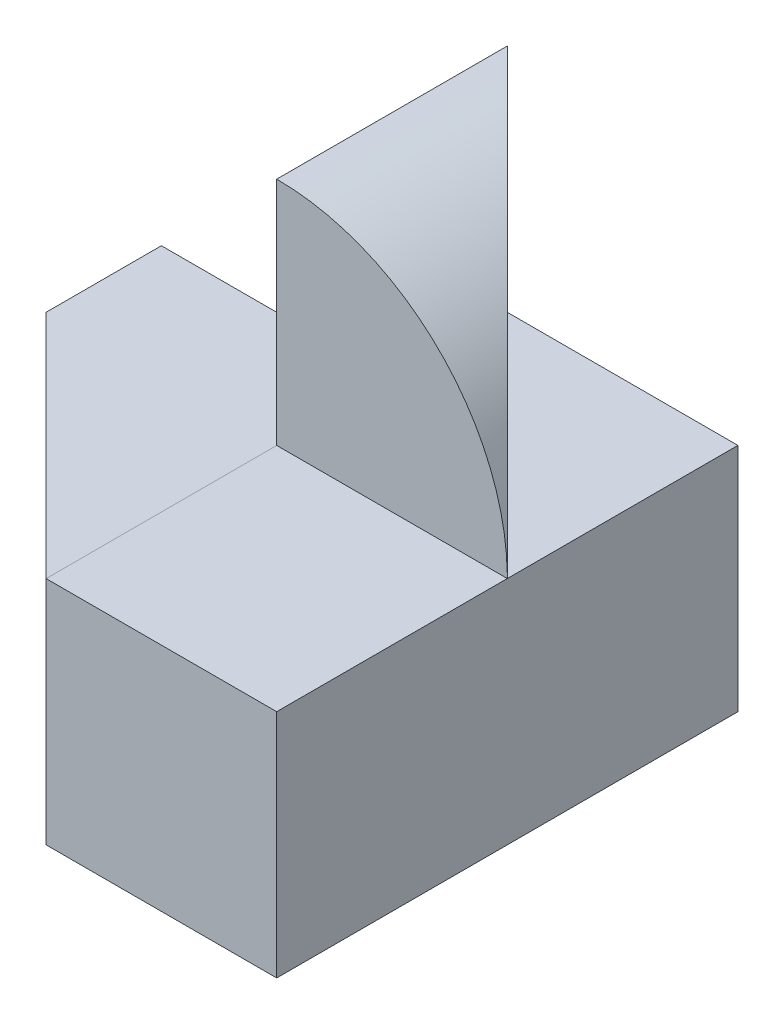
ISO-10303-21;
HEADER;
FILE_DESCRIPTION(('STEP AP214'),'2;1');
FILE_NAME('part.step','',(''),(''),'','','');
FILE_SCHEMA(('AUTOMOTIVE_DESIGN { 1 0 10303 214 1 1 1 1 }'));
ENDSEC;
DATA;
#1=APPLICATION_CONTEXT('core data for automotive mechanical design processes');
#2=APPLICATION_PROTOCOL_DEFINITION('international standard','automotive_design',2000,#1);
#3=PRODUCT_CONTEXT('',#1,'mechanical');
#4=PRODUCT('Part','Part','',(#3));
#5=PRODUCT_RELATED_PRODUCT_CATEGORY('part','',(#4));
#6=PRODUCT_DEFINITION_FORMATION('','',#4);
#7=PRODUCT_DEFINITION_CONTEXT('part definition',#1,'design');
#8=PRODUCT_DEFINITION('design','',#6,#7);
#9=PRODUCT_DEFINITION_SHAPE('','',#8);
#10=(LENGTH_UNIT() NAMED_UNIT(*) SI_UNIT(.MILLI.,.METRE.));
#11=(NAMED_UNIT(*) PLANE_ANGLE_UNIT() SI_UNIT($,.RADIAN.));
#12=(NAMED_UNIT(*) SI_UNIT($,.STERADIAN.) SOLID_ANGLE_UNIT());
#13=UNCERTAINTY_MEASURE_WITH_UNIT(LENGTH_MEASURE(1.E-05),#10,'distance_accuracy_value','');
#14=(GEOMETRIC_REPRESENTATION_CONTEXT(3) GLOBAL_UNCERTAINTY_ASSIGNED_CONTEXT((#13)) GLOBAL_UNIT_ASSIGNED_CONTEXT((#10,
#11,#12)) REPRESENTATION_CONTEXT('',''));
#15=CARTESIAN_POINT('',(0.,0.,0.));
#16=DIRECTION('',(0.,0.,1.));
#17=DIRECTION('',(1.,0.,0.));
#18=AXIS2_PLACEMENT_3D('',#15,#16,#17);
#19=CARTESIAN_POINT('',(0.,0.,0.));
#20=DIRECTION('',(0.,-1.,0.));
#21=DIRECTION('',(0.,0.,-1.));
#22=AXIS2_PLACEMENT_3D('',#19,#20,#21);
#23=PLANE('',#22);
#24=DIRECTION('',(1.,0.,0.));
#25=VECTOR('',#24,1.);
#26=CARTESIAN_POINT('',(-2.,0.,2.));
#27=LINE('',#26,#25);
#28=CARTESIAN_POINT('',(0.000305240086620776,0.,2.));
#29=VERTEX_POINT('',#28);
#30=CARTESIAN_POINT('',(2.,0.,2.));
#31=VERTEX_POINT('',#30);
#32=EDGE_CURVE('E168',#29,#31,#27,.T.);
#33=ORIENTED_EDGE('',*,*,#32,.F.);
#34=DIRECTION('',(0.707160730229535,0.,0.707052828027178));
#35=VECTOR('',#34,1.);
#36=CARTESIAN_POINT('',(-0.999847391603128,0.,0.999999976716006));
#37=LINE('',#36,#35);
#38=CARTESIAN_POINT('',(2.32893238651528E-08,-2.32893222935904E-08,1.99969482977424));
#39=VERTEX_POINT('',#38);
#40=EDGE_CURVE('E151',#39,#29,#37,.T.);
#41=ORIENTED_EDGE('',*,*,#40,.F.);
#42=DIRECTION('',(0.,0.,1.));
#43=VECTOR('',#42,1.);
#44=CARTESIAN_POINT('',(2.3289323594633E-08,-1.16446613636356E-08,0.));
#45=LINE('',#44,#43);
#46=CARTESIAN_POINT('',(2.3289323594633E-08,0.,0.));
#47=VERTEX_POINT('',#46);
#48=EDGE_CURVE('E160',#39,#47,#45,.F.);
#49=ORIENTED_EDGE('',*,*,#48,.T.);
#50=DIRECTION('',(1.,0.,0.));
#51=VECTOR('',#50,1.);
#52=CARTESIAN_POINT('',(-1.99999997671778,0.,0.));
#53=LINE('',#52,#51);
#54=CARTESIAN_POINT('',(-1.99999997671778,0.,0.));
#55=VERTEX_POINT('',#54);
#56=EDGE_CURVE('E144',#55,#47,#53,.T.);
#57=ORIENTED_EDGE('',*,*,#56,.F.);
#58=DIRECTION('',(0.,0.,1.));
#59=VECTOR('',#58,1.);
#60=CARTESIAN_POINT('',(-2.,0.,2.));
#61=LINE('',#60,#59);
#62=CARTESIAN_POINT('',(-2.,0.,-1.));
#63=VERTEX_POINT('',#62);
#64=EDGE_CURVE('E158',#63,#55,#61,.T.);
#65=ORIENTED_EDGE('',*,*,#64,.F.);
#66=CARTESIAN_POINT('',(-2.,0.,-2.));
#67=VERTEX_POINT('',#66);
#68=EDGE_CURVE('E165',#67,#63,#61,.T.);
#69=ORIENTED_EDGE('',*,*,#68,.F.);
#70=DIRECTION('',(-1.,0.,0.));
#71=VECTOR('',#70,1.);
#72=CARTESIAN_POINT('',(-2.,0.,-2.));
#73=LINE('',#72,#71);
#74=CARTESIAN_POINT('',(2.,0.,-2.));
#75=VERTEX_POINT('',#74);
#76=EDGE_CURVE('E166',#75,#67,#73,.T.);
#77=ORIENTED_EDGE('',*,*,#76,.F.);
#78=DIRECTION('',(0.,0.,-1.));
#79=VECTOR('',#78,1.);
#80=CARTESIAN_POINT('',(2.,0.,2.));
#81=LINE('',#80,#79);
#82=EDGE_CURVE('E170',#31,#75,#81,.T.);
#83=ORIENTED_EDGE('',*,*,#82,.F.);
#84=EDGE_LOOP('',(#33,#41,#49,#57,#65,#69,#77,#83));
#85=FACE_BOUND('',#84,.T.);
#86=ADVANCED_FACE('F54',(#85),#23,.T.);
#87=CARTESIAN_POINT('',(-2.,4.,2.));
#88=DIRECTION('',(1.,0.,0.));
#89=DIRECTION('',(0.,0.,-1.));
#90=AXIS2_PLACEMENT_3D('',#87,#88,#89);
#91=PLANE('',#90);
#92=DIRECTION('',(0.,1.,0.));
#93=VECTOR('',#92,1.);
#94=CARTESIAN_POINT('',(-2.,2.00000001164289,-1.));
#95=LINE('',#94,#93);
#96=CARTESIAN_POINT('',(-2.,2.00000001164289,-1.));
#97=VERTEX_POINT('',#96);
#98=EDGE_CURVE('E164',#63,#97,#95,.T.);
#99=ORIENTED_EDGE('',*,*,#98,.F.);
#100=ORIENTED_EDGE('',*,*,#64,.T.);
#101=DIRECTION('',(-1.16411092617487E-08,1.,0.));
#102=VECTOR('',#101,1.);
#103=CARTESIAN_POINT('',(-1.99999995343556,-2.,0.));
#104=LINE('',#103,#102);
#105=CARTESIAN_POINT('',(-2.,2.,0.));
#106=VERTEX_POINT('',#105);
#107=EDGE_CURVE('E141',#55,#106,#104,.T.);
#108=ORIENTED_EDGE('',*,*,#107,.T.);
#109=DIRECTION('',(0.,0.,1.));
#110=VECTOR('',#109,1.);
#111=CARTESIAN_POINT('',(-2.,2.00000001164289,-2.));
#112=LINE('',#111,#110);
#113=EDGE_CURVE('E188',#97,#106,#112,.T.);
#114=ORIENTED_EDGE('',*,*,#113,.F.);
#115=EDGE_LOOP('',(#99,#100,#108,#114));
#116=FACE_BOUND('',#115,.T.);
#117=ADVANCED_FACE('F163',(#116),#91,.F.);
#118=CARTESIAN_POINT('',(-2.32822187945282E-08,2.00000002328222,-2.));
#119=DIRECTION('',(-1.16411092617487E-08,1.,0.));
#120=DIRECTION('',(-1.,-1.16411092617487E-08,0.));
#121=AXIS2_PLACEMENT_3D('',#118,#119,#120);
#122=PLANE('',#121);
#123=DIRECTION('',(0.,0.,1.));
#124=VECTOR('',#123,1.);
#125=CARTESIAN_POINT('',(0.000305193522183662,2.00000002328577,-2.));
#126=LINE('',#125,#124);
#127=CARTESIAN_POINT('',(0.000305193522183662,2.00000002328577,-1.));
#128=VERTEX_POINT('',#127);
#129=CARTESIAN_POINT('',(0.000305193522183662,2.00000002328577,0.));
#130=VERTEX_POINT('',#129);
#131=EDGE_CURVE('E192',#128,#130,#126,.T.);
#132=ORIENTED_EDGE('',*,*,#131,.F.);
#133=DIRECTION('',(1.,5.82055452247066E-09,0.));
#134=VECTOR('',#133,1.);
#135=CARTESIAN_POINT('',(0.000305193522183662,2.00000002328577,-1.));
#136=LINE('',#135,#134);
#137=EDGE_CURVE('E264',#97,#128,#136,.T.);
#138=ORIENTED_EDGE('',*,*,#137,.F.);
#139=ORIENTED_EDGE('',*,*,#113,.T.);
#140=DIRECTION('',(-0.707160730229535,-8.23213523040343E-09,-0.707052828027178));
#141=VECTOR('',#140,1.);
#142=CARTESIAN_POINT('',(0.000305216804401982,2.00000002328577,2.));
#143=LINE('',#142,#141);
#144=CARTESIAN_POINT('',(0.000305193522183662,2.00000002328577,2.));
#145=VERTEX_POINT('',#144);
#146=EDGE_CURVE('E232',#145,#106,#143,.T.);
#147=ORIENTED_EDGE('',*,*,#146,.F.);
#148=DIRECTION('',(0.,0.,1.));
#149=VECTOR('',#148,1.);
#150=CARTESIAN_POINT('',(0.000305193522183662,2.00000002328577,2.));
#151=LINE('',#150,#149);
#152=EDGE_CURVE('E210',#130,#145,#151,.T.);
#153=ORIENTED_EDGE('',*,*,#152,.F.);
#154=EDGE_LOOP('',(#132,#138,#139,#147,#153));
#155=FACE_BOUND('',#154,.T.);
#156=ADVANCED_FACE('F277',(#155),#122,.T.);
#157=CARTESIAN_POINT('',(-2.,4.,-2.));
#158=DIRECTION('',(0.,0.,1.));
#159=DIRECTION('',(1.,0.,0.));
#160=AXIS2_PLACEMENT_3D('',#157,#158,#159);
#161=PLANE('',#160);
#162=ORIENTED_EDGE('',*,*,#76,.T.);
#163=DIRECTION('',(-0.707160721998656,-0.707052836259313,0.));
#164=VECTOR('',#163,1.);
#165=CARTESIAN_POINT('',(-2.,0.,-2.));
#166=LINE('',#165,#164);
#167=CARTESIAN_POINT('',(0.000305193522183662,2.00000002328577,-2.));
#168=VERTEX_POINT('',#167);
#169=EDGE_CURVE('E252',#168,#67,#166,.T.);
#170=ORIENTED_EDGE('',*,*,#169,.F.);
#171=DIRECTION('',(0.000152596761092048,-0.999999988357114,0.));
#172=VECTOR('',#171,1.);
#173=CARTESIAN_POINT('',(0.00061038703726109,9.31430859830675E-08,-2.));
#174=LINE('',#173,#172);
#175=CARTESIAN_POINT('',(0.,4.,-2.));
#176=VERTEX_POINT('',#175);
#177=EDGE_CURVE('E184',#176,#168,#174,.T.);
#178=ORIENTED_EDGE('',*,*,#177,.F.);
#179=DIRECTION('',(1.,0.,0.));
#180=VECTOR('',#179,1.);
#181=CARTESIAN_POINT('',(0.,4.,-2.));
#182=LINE('',#181,#180);
#183=CARTESIAN_POINT('',(0.000305193519518661,4.00000002328577,-2.));
#184=VERTEX_POINT('',#183);
#185=EDGE_CURVE('E176',#184,#176,#182,.F.);
#186=ORIENTED_EDGE('',*,*,#185,.F.);
#187=DIRECTION('',(0.000152596761092048,-0.999999988357114,0.));
#188=VECTOR('',#187,1.);
#189=CARTESIAN_POINT('',(-0.000915580572771053,11.9999999534285,-2.));
#190=LINE('',#189,#188);
#191=CARTESIAN_POINT('',(0.000610387038149423,2.00000006985732,-2.));
#192=VERTEX_POINT('',#191);
#193=EDGE_CURVE('E214',#184,#192,#190,.T.);
#194=ORIENTED_EDGE('',*,*,#193,.T.);
#195=DIRECTION('',(-0.999999988357114,-0.000152596761091958,0.));
#196=VECTOR('',#195,1.);
#197=CARTESIAN_POINT('',(0.000610387038149423,2.00000006985732,-2.));
#198=LINE('',#197,#196);
#199=CARTESIAN_POINT('',(2.00000528489849,2.00030517104642,-2.));
#200=VERTEX_POINT('',#199);
#201=EDGE_CURVE('E254',#200,#192,#198,.T.);
#202=ORIENTED_EDGE('',*,*,#201,.F.);
#203=DIRECTION('',(0.,-1.,0.));
#204=VECTOR('',#203,1.);
#205=CARTESIAN_POINT('',(2.,4.,-2.));
#206=LINE('',#205,#204);
#207=EDGE_CURVE('E179',#200,#75,#206,.T.);
#208=ORIENTED_EDGE('',*,*,#207,.T.);
#209=EDGE_LOOP('',(#162,#170,#178,#186,#194,#202,#208));
#210=FACE_BOUND('',#209,.T.);
#211=ADVANCED_FACE('F250',(#210),#161,.F.);
#212=CARTESIAN_POINT('',(2.,4.,2.));
#213=DIRECTION('',(-1.,0.,0.));
#214=DIRECTION('',(0.,0.,1.));
#215=AXIS2_PLACEMENT_3D('',#212,#213,#214);
#216=PLANE('',#215);
#217=DIRECTION('',(0.,0.,-1.));
#218=VECTOR('',#217,1.);
#219=CARTESIAN_POINT('',(2.00000528489849,2.00030517104642,-2.));
#220=LINE('',#219,#218);
#221=CARTESIAN_POINT('',(2.00000528489849,2.00030517104642,0.));
#222=VERTEX_POINT('',#221);
#223=EDGE_CURVE('E258',#222,#200,#220,.T.);
#224=ORIENTED_EDGE('',*,*,#223,.F.);
#225=DIRECTION('',(0.,0.,1.));
#226=VECTOR('',#225,1.);
#227=CARTESIAN_POINT('',(2.,2.00030517023997,2.));
#228=LINE('',#227,#226);
#229=CARTESIAN_POINT('',(2.,2.00030517023997,2.));
#230=VERTEX_POINT('',#229);
#231=EDGE_CURVE('E229',#222,#230,#228,.T.);
#232=ORIENTED_EDGE('',*,*,#231,.T.);
#233=DIRECTION('',(0.,-1.,0.));
#234=VECTOR('',#233,1.);
#235=CARTESIAN_POINT('',(2.,4.,2.));
#236=LINE('',#235,#234);
#237=EDGE_CURVE('E177',#230,#31,#236,.T.);
#238=ORIENTED_EDGE('',*,*,#237,.T.);
#239=ORIENTED_EDGE('',*,*,#82,.T.);
#240=ORIENTED_EDGE('',*,*,#207,.F.);
#241=EDGE_LOOP('',(#224,#232,#238,#239,#240));
#242=FACE_BOUND('',#241,.T.);
#243=ADVANCED_FACE('F56',(#242),#216,.F.);
#244=CARTESIAN_POINT('',(0.000305193522183661,2.00000002328577,-2.));
#245=DIRECTION('',(0.,0.,1.));
#246=DIRECTION('',(1.,0.,0.));
#247=AXIS2_PLACEMENT_3D('',#244,#245,#246);
#248=CYLINDRICAL_SURFACE('',#247,2.);
#249=CARTESIAN_POINT('',(0.000305193522183661,2.00000002328577,0.));
#250=DIRECTION('',(0.,0.,-1.));
#251=DIRECTION('',(-1.,0.,0.));
#252=AXIS2_PLACEMENT_3D('',#249,#250,#251);
#253=CIRCLE('',#252,2.);
#254=CARTESIAN_POINT('',(2.,2.03493826802776,0.));
#255=VERTEX_POINT('',#254);
#256=CARTESIAN_POINT('',(0.000305193518630731,4.00000004657154,0.));
#257=VERTEX_POINT('',#256);
#258=EDGE_CURVE('E63',#255,#257,#253,.F.);
#259=ORIENTED_EDGE('',*,*,#258,.F.);
#260=CARTESIAN_POINT('',(0.000305193522183661,2.00000002328577,-2.00030528588053));
#261=DIRECTION('',(0.707213744882939,0.000107918528125397,-0.706999793070861));
#262=DIRECTION('',(0.706999784839343,0.000107885878515361,0.707213753116948));
#263=AXIS2_PLACEMENT_3D('',#260,#261,#262);
#264=ELLIPSE('',#263,2.82885514196967,2.);
#265=EDGE_CURVE('E78',#255,#184,#264,.F.);
#266=ORIENTED_EDGE('',*,*,#265,.T.);
#267=DIRECTION('',(0.,0.,1.));
#268=VECTOR('',#267,1.);
#269=CARTESIAN_POINT('',(0.000305193522183661,4.00000001164289,-2.));
#270=LINE('',#269,#268);
#271=EDGE_CURVE('E181',#184,#257,#270,.T.);
#272=ORIENTED_EDGE('',*,*,#271,.T.);
#273=EDGE_LOOP('',(#259,#266,#272));
#274=FACE_BOUND('',#273,.T.);
#275=ADVANCED_FACE('F212',(#274),#248,.T.);
#276=CARTESIAN_POINT('',(-2.,4.,2.));
#277=DIRECTION('',(0.,0.,-1.));
#278=DIRECTION('',(-1.,0.,0.));
#279=AXIS2_PLACEMENT_3D('',#276,#277,#278);
#280=PLANE('',#279);
#281=ORIENTED_EDGE('',*,*,#237,.F.);
#282=DIRECTION('',(-0.999999988357114,-0.000152596761092048,0.));
#283=VECTOR('',#282,1.);
#284=CARTESIAN_POINT('',(4.00030514695064,2.00061041033014,2.));
#285=LINE('',#284,#283);
#286=EDGE_CURVE('E223',#230,#145,#285,.T.);
#287=ORIENTED_EDGE('',*,*,#286,.T.);
#288=DIRECTION('',(-1.16411092617487E-08,1.,0.));
#289=VECTOR('',#288,1.);
#290=CARTESIAN_POINT('',(0.000305263368839029,-1.99999997671423,2.));
#291=LINE('',#290,#289);
#292=EDGE_CURVE('E152',#29,#145,#291,.T.);
#293=ORIENTED_EDGE('',*,*,#292,.F.);
#294=ORIENTED_EDGE('',*,*,#32,.T.);
#295=EDGE_LOOP('',(#281,#287,#293,#294));
#296=FACE_BOUND('',#295,.T.);
#297=ADVANCED_FACE('F302',(#296),#280,.F.);
#298=CARTESIAN_POINT('',(0.,4.,0.));
#299=DIRECTION('',(0.,-1.,0.));
#300=DIRECTION('',(0.,0.,-1.));
#301=AXIS2_PLACEMENT_3D('',#298,#299,#300);
#302=PLANE('',#301);
#303=DIRECTION('',(0.,0.,1.));
#304=VECTOR('',#303,1.);
#305=CARTESIAN_POINT('',(0.,4.,-2.));
#306=LINE('',#305,#304);
#307=CARTESIAN_POINT('',(0.,4.,0.));
#308=VERTEX_POINT('',#307);
#309=EDGE_CURVE('E185',#176,#308,#306,.T.);
#310=ORIENTED_EDGE('',*,*,#309,.T.);
#311=DIRECTION('',(-0.999999988357114,-0.000152596761092048,0.));
#312=VECTOR('',#311,1.);
#313=CARTESIAN_POINT('',(3.99999995342846,4.00061038704437,0.));
#314=LINE('',#313,#312);
#315=EDGE_CURVE('E199',#257,#308,#314,.T.);
#316=ORIENTED_EDGE('',*,*,#315,.F.);
#317=ORIENTED_EDGE('',*,*,#271,.F.);
#318=ORIENTED_EDGE('',*,*,#185,.T.);
#319=EDGE_LOOP('',(#310,#316,#317,#318));
#320=FACE_BOUND('',#319,.T.);
#321=ADVANCED_FACE('F206',(#320),#302,.F.);
#322=CARTESIAN_POINT('',(0.00061038703726109,9.31430859830675E-08,-2.));
#323=DIRECTION('',(-0.999999988357114,-0.000152596761092047,0.));
#324=DIRECTION('',(0.000152596761092048,-0.999999988357114,0.));
#325=AXIS2_PLACEMENT_3D('',#322,#323,#324);
#326=PLANE('',#325);
#327=DIRECTION('',(0.000152596761092048,-0.999999988357114,0.));
#328=VECTOR('',#327,1.);
#329=CARTESIAN_POINT('',(0.,4.,0.));
#330=LINE('',#329,#328);
#331=EDGE_CURVE('E213',#308,#130,#330,.T.);
#332=ORIENTED_EDGE('',*,*,#331,.F.);
#333=ORIENTED_EDGE('',*,*,#309,.F.);
#334=ORIENTED_EDGE('',*,*,#177,.T.);
#335=EDGE_CURVE('E189',#168,#128,#126,.T.);
#336=ORIENTED_EDGE('',*,*,#335,.T.);
#337=ORIENTED_EDGE('',*,*,#131,.T.);
#338=EDGE_LOOP('',(#332,#333,#334,#336,#337));
#339=FACE_BOUND('',#338,.T.);
#340=ADVANCED_FACE('F281',(#339),#326,.T.);
#341=CARTESIAN_POINT('',(0.000305263368839029,-1.99999997671423,2.));
#342=DIRECTION('',(0.707052828027178,8.23087922489277E-09,-0.707160730229535));
#343=DIRECTION('',(-0.707160730229535,0.,-0.707052828027178));
#344=AXIS2_PLACEMENT_3D('',#341,#342,#343);
#345=PLANE('',#344);
#346=ORIENTED_EDGE('',*,*,#146,.T.);
#347=CARTESIAN_POINT('',(2.3289323594633E-08,2.,1.99969485305291));
#348=DIRECTION('',(0.707052828027178,8.23087922489277E-09,-0.707160730229535));
#349=DIRECTION('',(0.707160730229535,8.23213532621999E-09,0.707052828027178));
#350=AXIS2_PLACEMENT_3D('',#347,#348,#349);
#351=ELLIPSE('',#350,2.82821137797082,2.00000002328932);
#352=EDGE_CURVE('E12',#106,#39,#351,.F.);
#353=ORIENTED_EDGE('',*,*,#352,.T.);
#354=ORIENTED_EDGE('',*,*,#40,.T.);
#355=ORIENTED_EDGE('',*,*,#292,.T.);
#356=EDGE_LOOP('',(#346,#353,#354,#355));
#357=FACE_BOUND('',#356,.T.);
#358=ADVANCED_FACE('F315',(#357),#345,.F.);
#359=CARTESIAN_POINT('',(4.00030514695064,2.00061041033014,2.));
#360=DIRECTION('',(0.000152596761092048,-0.999999988357114,0.));
#361=DIRECTION('',(0.999999988357114,0.000152596761092048,0.));
#362=AXIS2_PLACEMENT_3D('',#359,#360,#361);
#363=PLANE('',#362);
#364=DIRECTION('',(-0.999999988357114,-0.000152596761092048,0.));
#365=VECTOR('',#364,1.);
#366=CARTESIAN_POINT('',(4.00030514695064,2.00061041033014,0.));
#367=LINE('',#366,#365);
#368=EDGE_CURVE('E209',#222,#130,#367,.T.);
#369=ORIENTED_EDGE('',*,*,#368,.T.);
#370=ORIENTED_EDGE('',*,*,#152,.T.);
#371=ORIENTED_EDGE('',*,*,#286,.F.);
#372=ORIENTED_EDGE('',*,*,#231,.F.);
#373=EDGE_LOOP('',(#369,#370,#371,#372));
#374=FACE_BOUND('',#373,.T.);
#375=ADVANCED_FACE('F320',(#374),#363,.F.);
#376=CARTESIAN_POINT('',(3.99999995342846,4.00061038704437,0.));
#377=DIRECTION('',(0.,0.,-1.));
#378=DIRECTION('',(-1.,0.,0.));
#379=AXIS2_PLACEMENT_3D('',#376,#377,#378);
#380=PLANE('',#379);
#381=ORIENTED_EDGE('',*,*,#258,.T.);
#382=ORIENTED_EDGE('',*,*,#315,.T.);
#383=ORIENTED_EDGE('',*,*,#331,.T.);
#384=ORIENTED_EDGE('',*,*,#368,.F.);
#385=DIRECTION('',(0.,-1.,0.));
#386=VECTOR('',#385,1.);
#387=CARTESIAN_POINT('',(2.,4.,0.));
#388=LINE('',#387,#386);
#389=EDGE_CURVE('E202',#255,#222,#388,.T.);
#390=ORIENTED_EDGE('',*,*,#389,.F.);
#391=EDGE_LOOP('',(#381,#382,#383,#384,#390));
#392=FACE_BOUND('',#391,.T.);
#393=ADVANCED_FACE('F197',(#392),#380,.F.);
#394=CARTESIAN_POINT('',(1.99847931728757,12.0003050546176,0.));
#395=DIRECTION('',(0.707213744882939,0.000107918528125397,-0.706999793070861));
#396=DIRECTION('',(-0.706999797187865,0.,-0.707213749001189));
#397=AXIS2_PLACEMENT_3D('',#394,#395,#396);
#398=PLANE('',#397);
#399=ORIENTED_EDGE('',*,*,#389,.T.);
#400=DIRECTION('',(0.706999784839343,0.000107885878515298,0.707213753116948));
#401=VECTOR('',#400,1.);
#402=CARTESIAN_POINT('',(2.00000528489849,2.00030517104642,0.));
#403=LINE('',#402,#401);
#404=EDGE_CURVE('E218',#192,#222,#403,.T.);
#405=ORIENTED_EDGE('',*,*,#404,.F.);
#406=ORIENTED_EDGE('',*,*,#193,.F.);
#407=ORIENTED_EDGE('',*,*,#265,.F.);
#408=EDGE_LOOP('',(#399,#405,#406,#407));
#409=FACE_BOUND('',#408,.T.);
#410=ADVANCED_FACE('F291',(#409),#398,.T.);
#411=CARTESIAN_POINT('',(-0.00030519351507725,1.99999993014269,0.));
#412=DIRECTION('',(-0.000152596761091958,0.999999988357114,0.));
#413=DIRECTION('',(-0.999999988357114,-0.000152596761091958,0.));
#414=AXIS2_PLACEMENT_3D('',#411,#412,#413);
#415=PLANE('',#414);
#416=ORIENTED_EDGE('',*,*,#223,.T.);
#417=ORIENTED_EDGE('',*,*,#201,.T.);
#418=ORIENTED_EDGE('',*,*,#404,.T.);
#419=EDGE_LOOP('',(#416,#417,#418));
#420=FACE_BOUND('',#419,.T.);
#421=ADVANCED_FACE('F284',(#420),#415,.T.);
#422=CARTESIAN_POINT('',(-2.,0.,-1.));
#423=DIRECTION('',(0.707052836259313,-0.707160721998656,0.));
#424=DIRECTION('',(0.707160721998656,0.707052836259313,0.));
#425=AXIS2_PLACEMENT_3D('',#422,#423,#424);
#426=PLANE('',#425);
#427=ORIENTED_EDGE('',*,*,#169,.T.);
#428=ORIENTED_EDGE('',*,*,#68,.T.);
#429=DIRECTION('',(-0.707160721998656,-0.707052836259313,0.));
#430=VECTOR('',#429,1.);
#431=CARTESIAN_POINT('',(-2.,0.,-1.));
#432=LINE('',#431,#430);
#433=EDGE_CURVE('E70',#128,#63,#432,.T.);
#434=ORIENTED_EDGE('',*,*,#433,.F.);
#435=ORIENTED_EDGE('',*,*,#335,.F.);
#436=EDGE_LOOP('',(#427,#428,#434,#435));
#437=FACE_BOUND('',#436,.T.);
#438=ADVANCED_FACE('F282',(#437),#426,.F.);
#439=CARTESIAN_POINT('',(0.,0.,-1.));
#440=DIRECTION('',(0.,0.,-1.));
#441=DIRECTION('',(-1.,0.,0.));
#442=AXIS2_PLACEMENT_3D('',#439,#440,#441);
#443=PLANE('',#442);
#444=ORIENTED_EDGE('',*,*,#98,.T.);
#445=ORIENTED_EDGE('',*,*,#137,.T.);
#446=ORIENTED_EDGE('',*,*,#433,.T.);
#447=EDGE_LOOP('',(#444,#445,#446));
#448=FACE_BOUND('',#447,.T.);
#449=ADVANCED_FACE('F274',(#448),#443,.T.);
#450=CARTESIAN_POINT('',(2.3289323594633E-08,2.,0.));
#451=DIRECTION('',(0.,0.,-1.));
#452=DIRECTION('',(-1.,0.,0.));
#453=AXIS2_PLACEMENT_3D('',#450,#451,#452);
#454=PLANE('',#453);
#455=CARTESIAN_POINT('',(2.3289323594633E-08,2.,0.));
#456=DIRECTION('',(0.,0.,-1.));
#457=DIRECTION('',(-1.,0.,0.));
#458=AXIS2_PLACEMENT_3D('',#455,#456,#457);
#459=CIRCLE('',#458,2.00000002328932);
#460=EDGE_CURVE('E146',#47,#106,#459,.T.);
#461=ORIENTED_EDGE('',*,*,#460,.T.);
#462=ORIENTED_EDGE('',*,*,#107,.F.);
#463=ORIENTED_EDGE('',*,*,#56,.T.);
#464=EDGE_LOOP('',(#461,#462,#463));
#465=FACE_BOUND('',#464,.T.);
#466=ADVANCED_FACE('F143',(#465),#454,.F.);
#467=CARTESIAN_POINT('',(2.3289323594633E-08,2.,0.));
#468=DIRECTION('',(0.,0.,1.));
#469=DIRECTION('',(1.,0.,0.));
#470=AXIS2_PLACEMENT_3D('',#467,#468,#469);
#471=CYLINDRICAL_SURFACE('',#470,2.00000002328932);
#472=ORIENTED_EDGE('',*,*,#352,.F.);
#473=ORIENTED_EDGE('',*,*,#460,.F.);
#474=ORIENTED_EDGE('',*,*,#48,.F.);
#475=EDGE_LOOP('',(#472,#473,#474));
#476=FACE_BOUND('',#475,.T.);
#477=ADVANCED_FACE('F333',(#476),#471,.T.);
#478=CLOSED_SHELL('',(#86,#117,#156,#211,#243,#275,#297,#321,#340,#358,#375,#393,#410,#421,#438,
#449,#466,#477));
#479=MANIFOLD_SOLID_BREP('B2',#478);
#480=ADVANCED_BREP_SHAPE_REPRESENTATION('',(#18,#479),#14);
#481=SHAPE_DEFINITION_REPRESENTATION(#9,#480);
ENDSEC;
END-ISO-10303-21;
